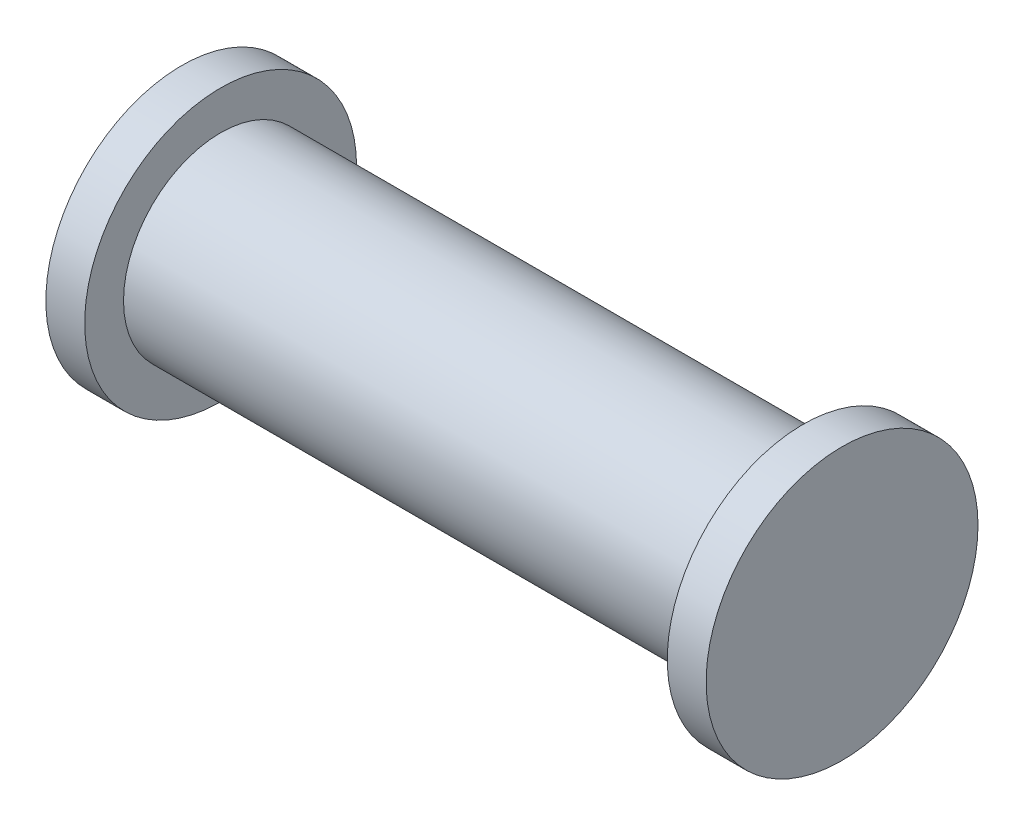
ISO-10303-21;
HEADER;
FILE_DESCRIPTION(('STEP AP214'),'2;1');
FILE_NAME('part.step','',(''),(''),'','','');
FILE_SCHEMA(('AUTOMOTIVE_DESIGN { 1 0 10303 214 1 1 1 1 }'));
ENDSEC;
DATA;
#1=APPLICATION_CONTEXT('core data for automotive mechanical design processes');
#2=APPLICATION_PROTOCOL_DEFINITION('international standard','automotive_design',2000,#1);
#3=PRODUCT_CONTEXT('',#1,'mechanical');
#4=PRODUCT('Part','Part','',(#3));
#5=PRODUCT_RELATED_PRODUCT_CATEGORY('part','',(#4));
#6=PRODUCT_DEFINITION_FORMATION('','',#4);
#7=PRODUCT_DEFINITION_CONTEXT('part definition',#1,'design');
#8=PRODUCT_DEFINITION('design','',#6,#7);
#9=PRODUCT_DEFINITION_SHAPE('','',#8);
#10=(LENGTH_UNIT() NAMED_UNIT(*) SI_UNIT(.MILLI.,.METRE.));
#11=(NAMED_UNIT(*) PLANE_ANGLE_UNIT() SI_UNIT($,.RADIAN.));
#12=(NAMED_UNIT(*) SI_UNIT($,.STERADIAN.) SOLID_ANGLE_UNIT());
#13=UNCERTAINTY_MEASURE_WITH_UNIT(LENGTH_MEASURE(1.E-05),#10,'distance_accuracy_value','');
#14=(GEOMETRIC_REPRESENTATION_CONTEXT(3) GLOBAL_UNCERTAINTY_ASSIGNED_CONTEXT((#13)) GLOBAL_UNIT_ASSIGNED_CONTEXT((#10,
#11,#12)) REPRESENTATION_CONTEXT('',''));
#15=CARTESIAN_POINT('',(0.,0.,0.));
#16=DIRECTION('',(0.,0.,1.));
#17=DIRECTION('',(1.,0.,0.));
#18=AXIS2_PLACEMENT_3D('',#15,#16,#17);
#19=CARTESIAN_POINT('',(37.5,0.,0.));
#20=DIRECTION('',(-1.,0.,0.));
#21=DIRECTION('',(0.,0.,1.));
#22=AXIS2_PLACEMENT_3D('',#19,#20,#21);
#23=CYLINDRICAL_SURFACE('',#22,12.5);
#24=CARTESIAN_POINT('',(37.5,0.,0.));
#25=DIRECTION('',(1.,0.,0.));
#26=DIRECTION('',(0.,0.,-1.));
#27=AXIS2_PLACEMENT_3D('',#24,#25,#26);
#28=CIRCLE('',#27,12.5);
#29=CARTESIAN_POINT('',(37.5,0.,-12.5));
#30=VERTEX_POINT('',#29);
#31=EDGE_CURVE('E10',#30,#30,#28,.T.);
#32=ORIENTED_EDGE('',*,*,#31,.F.);
#33=EDGE_LOOP('',(#32));
#34=FACE_BOUND('',#33,.T.);
#35=CARTESIAN_POINT('',(-37.5,0.,0.));
#36=DIRECTION('',(-1.,0.,0.));
#37=DIRECTION('',(0.,0.,1.));
#38=AXIS2_PLACEMENT_3D('',#35,#36,#37);
#39=CIRCLE('',#38,12.5);
#40=CARTESIAN_POINT('',(-37.5,0.,12.5));
#41=VERTEX_POINT('',#40);
#42=EDGE_CURVE('E45',#41,#41,#39,.T.);
#43=ORIENTED_EDGE('',*,*,#42,.F.);
#44=EDGE_LOOP('',(#43));
#45=FACE_BOUND('',#44,.T.);
#46=ADVANCED_FACE('F30',(#34,#45),#23,.T.);
#47=CARTESIAN_POINT('',(42.5,0.,0.));
#48=DIRECTION('',(-1.,0.,0.));
#49=DIRECTION('',(0.,0.,1.));
#50=AXIS2_PLACEMENT_3D('',#47,#48,#49);
#51=CYLINDRICAL_SURFACE('',#50,17.5);
#52=CARTESIAN_POINT('',(42.5,0.,0.));
#53=DIRECTION('',(1.,0.,0.));
#54=DIRECTION('',(0.,0.,-1.));
#55=AXIS2_PLACEMENT_3D('',#52,#53,#54);
#56=CIRCLE('',#55,17.5);
#57=CARTESIAN_POINT('',(42.5,0.,-17.5));
#58=VERTEX_POINT('',#57);
#59=EDGE_CURVE('E36',#58,#58,#56,.T.);
#60=ORIENTED_EDGE('',*,*,#59,.F.);
#61=EDGE_LOOP('',(#60));
#62=FACE_BOUND('',#61,.T.);
#63=CARTESIAN_POINT('',(37.5,0.,0.));
#64=DIRECTION('',(1.,0.,0.));
#65=DIRECTION('',(0.,0.,-1.));
#66=AXIS2_PLACEMENT_3D('',#63,#64,#65);
#67=CIRCLE('',#66,17.5);
#68=CARTESIAN_POINT('',(37.5,0.,-17.5));
#69=VERTEX_POINT('',#68);
#70=EDGE_CURVE('E40',#69,#69,#67,.T.);
#71=ORIENTED_EDGE('',*,*,#70,.T.);
#72=EDGE_LOOP('',(#71));
#73=FACE_BOUND('',#72,.T.);
#74=ADVANCED_FACE('F72',(#62,#73),#51,.T.);
#75=CARTESIAN_POINT('',(42.5,0.,0.));
#76=DIRECTION('',(1.,0.,0.));
#77=DIRECTION('',(0.,0.,-1.));
#78=AXIS2_PLACEMENT_3D('',#75,#76,#77);
#79=PLANE('',#78);
#80=ORIENTED_EDGE('',*,*,#59,.T.);
#81=EDGE_LOOP('',(#80));
#82=FACE_BOUND('',#81,.T.);
#83=ADVANCED_FACE('F77',(#82),#79,.T.);
#84=CARTESIAN_POINT('',(37.5,0.,0.));
#85=DIRECTION('',(1.,0.,0.));
#86=DIRECTION('',(0.,0.,-1.));
#87=AXIS2_PLACEMENT_3D('',#84,#85,#86);
#88=PLANE('',#87);
#89=ORIENTED_EDGE('',*,*,#31,.T.);
#90=EDGE_LOOP('',(#89));
#91=FACE_BOUND('',#90,.T.);
#92=ORIENTED_EDGE('',*,*,#70,.F.);
#93=EDGE_LOOP('',(#92));
#94=FACE_BOUND('',#93,.T.);
#95=ADVANCED_FACE('F69',(#91,#94),#88,.F.);
#96=CARTESIAN_POINT('',(-42.5,0.,0.));
#97=DIRECTION('',(1.,0.,0.));
#98=DIRECTION('',(0.,0.,-1.));
#99=AXIS2_PLACEMENT_3D('',#96,#97,#98);
#100=CYLINDRICAL_SURFACE('',#99,17.5);
#101=CARTESIAN_POINT('',(-42.5,0.,0.));
#102=DIRECTION('',(1.,0.,0.));
#103=DIRECTION('',(0.,0.,-1.));
#104=AXIS2_PLACEMENT_3D('',#101,#102,#103);
#105=CIRCLE('',#104,17.5);
#106=CARTESIAN_POINT('',(-42.5,0.,-17.5));
#107=VERTEX_POINT('',#106);
#108=EDGE_CURVE('E49',#107,#107,#105,.T.);
#109=ORIENTED_EDGE('',*,*,#108,.T.);
#110=EDGE_LOOP('',(#109));
#111=FACE_BOUND('',#110,.T.);
#112=CARTESIAN_POINT('',(-37.5,0.,0.));
#113=DIRECTION('',(1.,0.,0.));
#114=DIRECTION('',(0.,0.,-1.));
#115=AXIS2_PLACEMENT_3D('',#112,#113,#114);
#116=CIRCLE('',#115,17.5);
#117=CARTESIAN_POINT('',(-37.5,0.,-17.5));
#118=VERTEX_POINT('',#117);
#119=EDGE_CURVE('E50',#118,#118,#116,.T.);
#120=ORIENTED_EDGE('',*,*,#119,.F.);
#121=EDGE_LOOP('',(#120));
#122=FACE_BOUND('',#121,.T.);
#123=ADVANCED_FACE('F56',(#111,#122),#100,.T.);
#124=CARTESIAN_POINT('',(-42.5,0.,0.));
#125=DIRECTION('',(-1.,0.,0.));
#126=DIRECTION('',(0.,0.,-1.));
#127=AXIS2_PLACEMENT_3D('',#124,#125,#126);
#128=PLANE('',#127);
#129=ORIENTED_EDGE('',*,*,#108,.F.);
#130=EDGE_LOOP('',(#129));
#131=FACE_BOUND('',#130,.T.);
#132=ADVANCED_FACE('F59',(#131),#128,.T.);
#133=CARTESIAN_POINT('',(-37.5,0.,0.));
#134=DIRECTION('',(-1.,0.,0.));
#135=DIRECTION('',(0.,0.,-1.));
#136=AXIS2_PLACEMENT_3D('',#133,#134,#135);
#137=PLANE('',#136);
#138=ORIENTED_EDGE('',*,*,#42,.T.);
#139=EDGE_LOOP('',(#138));
#140=FACE_BOUND('',#139,.T.);
#141=ORIENTED_EDGE('',*,*,#119,.T.);
#142=EDGE_LOOP('',(#141));
#143=FACE_BOUND('',#142,.T.);
#144=ADVANCED_FACE('F61',(#140,#143),#137,.F.);
#145=CLOSED_SHELL('',(#46,#74,#83,#95,#123,#132,#144));
#146=MANIFOLD_SOLID_BREP('B2',#145);
#147=ADVANCED_BREP_SHAPE_REPRESENTATION('',(#18,#146),#14);
#148=SHAPE_DEFINITION_REPRESENTATION(#9,#147);
ENDSEC;
END-ISO-10303-21;
